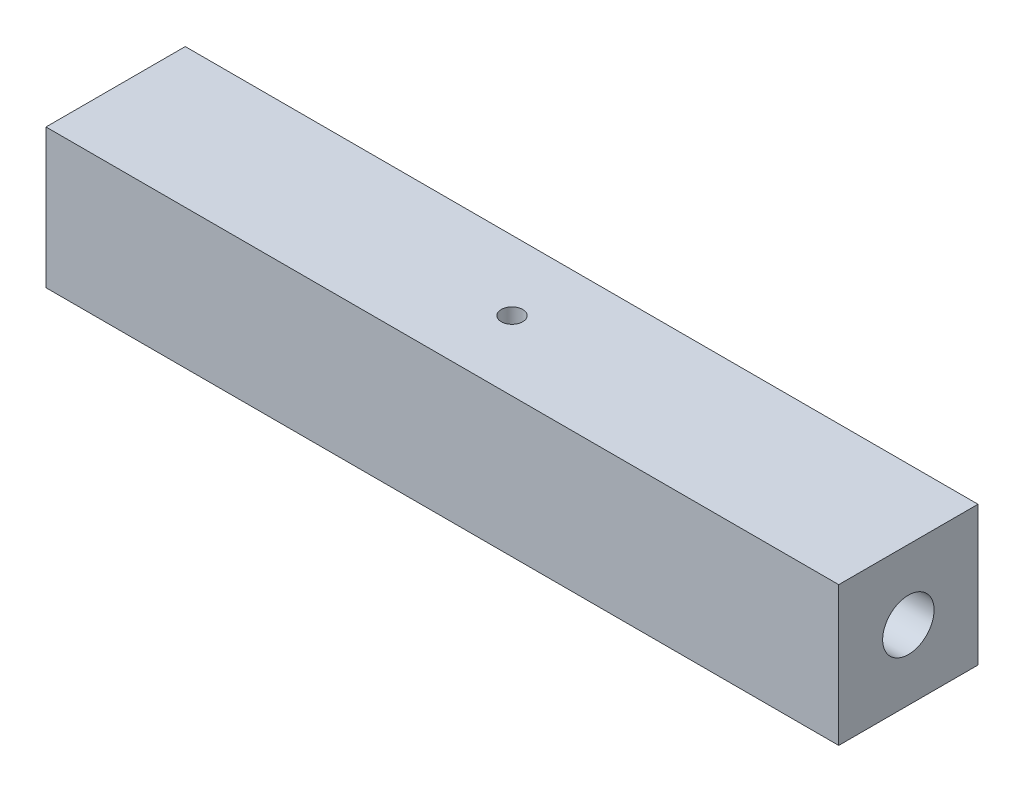
ISO-10303-21;
HEADER;
FILE_DESCRIPTION(('STEP AP214'),'2;1');
FILE_NAME('part.step','',(''),(''),'','','');
FILE_SCHEMA(('AUTOMOTIVE_DESIGN { 1 0 10303 214 1 1 1 1 }'));
ENDSEC;
DATA;
#1=APPLICATION_CONTEXT('core data for automotive mechanical design processes');
#2=APPLICATION_PROTOCOL_DEFINITION('international standard','automotive_design',2000,#1);
#3=PRODUCT_CONTEXT('',#1,'mechanical');
#4=PRODUCT('Part','Part','',(#3));
#5=PRODUCT_RELATED_PRODUCT_CATEGORY('part','',(#4));
#6=PRODUCT_DEFINITION_FORMATION('','',#4);
#7=PRODUCT_DEFINITION_CONTEXT('part definition',#1,'design');
#8=PRODUCT_DEFINITION('design','',#6,#7);
#9=PRODUCT_DEFINITION_SHAPE('','',#8);
#10=(LENGTH_UNIT() NAMED_UNIT(*) SI_UNIT(.MILLI.,.METRE.));
#11=(NAMED_UNIT(*) PLANE_ANGLE_UNIT() SI_UNIT($,.RADIAN.));
#12=(NAMED_UNIT(*) SI_UNIT($,.STERADIAN.) SOLID_ANGLE_UNIT());
#13=UNCERTAINTY_MEASURE_WITH_UNIT(LENGTH_MEASURE(1.E-05),#10,'distance_accuracy_value','');
#14=(GEOMETRIC_REPRESENTATION_CONTEXT(3) GLOBAL_UNCERTAINTY_ASSIGNED_CONTEXT((#13)) GLOBAL_UNIT_ASSIGNED_CONTEXT((#10,
#11,#12)) REPRESENTATION_CONTEXT('',''));
#15=CARTESIAN_POINT('',(0.,0.,0.));
#16=DIRECTION('',(0.,0.,1.));
#17=DIRECTION('',(1.,0.,0.));
#18=AXIS2_PLACEMENT_3D('',#15,#16,#17);
#19=CARTESIAN_POINT('',(46.99,8.255,8.255));
#20=DIRECTION('',(0.,-1.,0.));
#21=DIRECTION('',(0.,0.,-1.));
#22=AXIS2_PLACEMENT_3D('',#19,#20,#21);
#23=PLANE('',#22);
#24=DIRECTION('',(0.,0.,1.));
#25=VECTOR('',#24,1.);
#26=CARTESIAN_POINT('',(-46.99,8.255,8.255));
#27=LINE('',#26,#25);
#28=CARTESIAN_POINT('',(-46.99,8.255,-8.255));
#29=VERTEX_POINT('',#28);
#30=CARTESIAN_POINT('',(-46.99,8.255,8.255));
#31=VERTEX_POINT('',#30);
#32=EDGE_CURVE('E88',#29,#31,#27,.T.);
#33=ORIENTED_EDGE('',*,*,#32,.T.);
#34=DIRECTION('',(-1.,0.,0.));
#35=VECTOR('',#34,1.);
#36=CARTESIAN_POINT('',(46.99,8.255,8.255));
#37=LINE('',#36,#35);
#38=CARTESIAN_POINT('',(46.99,8.255,8.255));
#39=VERTEX_POINT('',#38);
#40=EDGE_CURVE('E41',#39,#31,#37,.T.);
#41=ORIENTED_EDGE('',*,*,#40,.F.);
#42=DIRECTION('',(0.,0.,1.));
#43=VECTOR('',#42,1.);
#44=CARTESIAN_POINT('',(46.99,8.255,8.255));
#45=LINE('',#44,#43);
#46=CARTESIAN_POINT('',(46.99,8.255,-8.255));
#47=VERTEX_POINT('',#46);
#48=EDGE_CURVE('E79',#47,#39,#45,.T.);
#49=ORIENTED_EDGE('',*,*,#48,.F.);
#50=DIRECTION('',(-1.,0.,0.));
#51=VECTOR('',#50,1.);
#52=CARTESIAN_POINT('',(46.99,8.255,-8.255));
#53=LINE('',#52,#51);
#54=EDGE_CURVE('E11',#47,#29,#53,.T.);
#55=ORIENTED_EDGE('',*,*,#54,.T.);
#56=EDGE_LOOP('',(#33,#41,#49,#55));
#57=FACE_BOUND('',#56,.T.);
#58=CARTESIAN_POINT('',(0.,8.255,0.));
#59=DIRECTION('',(0.,-1.,0.));
#60=DIRECTION('',(0.,0.,-1.));
#61=AXIS2_PLACEMENT_3D('',#58,#59,#60);
#62=CIRCLE('',#61,1.27);
#63=CARTESIAN_POINT('',(0.,8.255,-1.27));
#64=VERTEX_POINT('',#63);
#65=EDGE_CURVE('E124',#64,#64,#62,.T.);
#66=ORIENTED_EDGE('',*,*,#65,.T.);
#67=EDGE_LOOP('',(#66));
#68=FACE_BOUND('',#67,.T.);
#69=ADVANCED_FACE('F32',(#57,#68),#23,.F.);
#70=CARTESIAN_POINT('',(46.99,-8.255,8.255));
#71=DIRECTION('',(0.,1.,0.));
#72=DIRECTION('',(0.,0.,1.));
#73=AXIS2_PLACEMENT_3D('',#70,#71,#72);
#74=PLANE('',#73);
#75=DIRECTION('',(0.,0.,-1.));
#76=VECTOR('',#75,1.);
#77=CARTESIAN_POINT('',(-46.99,-8.255,8.255));
#78=LINE('',#77,#76);
#79=CARTESIAN_POINT('',(-46.99,-8.255,8.255));
#80=VERTEX_POINT('',#79);
#81=CARTESIAN_POINT('',(-46.99,-8.255,-8.255));
#82=VERTEX_POINT('',#81);
#83=EDGE_CURVE('E72',#80,#82,#78,.T.);
#84=ORIENTED_EDGE('',*,*,#83,.T.);
#85=DIRECTION('',(-1.,0.,0.));
#86=VECTOR('',#85,1.);
#87=CARTESIAN_POINT('',(46.99,-8.255,-8.255));
#88=LINE('',#87,#86);
#89=CARTESIAN_POINT('',(46.99,-8.255,-8.255));
#90=VERTEX_POINT('',#89);
#91=EDGE_CURVE('E92',#90,#82,#88,.T.);
#92=ORIENTED_EDGE('',*,*,#91,.F.);
#93=DIRECTION('',(0.,0.,-1.));
#94=VECTOR('',#93,1.);
#95=CARTESIAN_POINT('',(46.99,-8.255,8.255));
#96=LINE('',#95,#94);
#97=CARTESIAN_POINT('',(46.99,-8.255,8.255));
#98=VERTEX_POINT('',#97);
#99=EDGE_CURVE('E49',#98,#90,#96,.T.);
#100=ORIENTED_EDGE('',*,*,#99,.F.);
#101=DIRECTION('',(-1.,0.,0.));
#102=VECTOR('',#101,1.);
#103=CARTESIAN_POINT('',(46.99,-8.255,8.255));
#104=LINE('',#103,#102);
#105=EDGE_CURVE('E89',#98,#80,#104,.T.);
#106=ORIENTED_EDGE('',*,*,#105,.T.);
#107=EDGE_LOOP('',(#84,#92,#100,#106));
#108=FACE_BOUND('',#107,.T.);
#109=CARTESIAN_POINT('',(0.,-8.255,0.));
#110=DIRECTION('',(0.,-1.,0.));
#111=DIRECTION('',(0.,0.,-1.));
#112=AXIS2_PLACEMENT_3D('',#109,#110,#111);
#113=CIRCLE('',#112,1.27);
#114=CARTESIAN_POINT('',(0.,-8.255,-1.27));
#115=VERTEX_POINT('',#114);
#116=EDGE_CURVE('E121',#115,#115,#113,.T.);
#117=ORIENTED_EDGE('',*,*,#116,.F.);
#118=EDGE_LOOP('',(#117));
#119=FACE_BOUND('',#118,.T.);
#120=ADVANCED_FACE('F104',(#108,#119),#74,.F.);
#121=CARTESIAN_POINT('',(-46.99,0.,0.));
#122=DIRECTION('',(1.,0.,0.));
#123=DIRECTION('',(0.,0.,-1.));
#124=AXIS2_PLACEMENT_3D('',#121,#122,#123);
#125=PLANE('',#124);
#126=DIRECTION('',(0.,1.,0.));
#127=VECTOR('',#126,1.);
#128=CARTESIAN_POINT('',(-46.99,8.255,-8.255));
#129=LINE('',#128,#127);
#130=EDGE_CURVE('E96',#82,#29,#129,.T.);
#131=ORIENTED_EDGE('',*,*,#130,.F.);
#132=ORIENTED_EDGE('',*,*,#83,.F.);
#133=DIRECTION('',(0.,-1.,0.));
#134=VECTOR('',#133,1.);
#135=CARTESIAN_POINT('',(-46.99,8.255,8.255));
#136=LINE('',#135,#134);
#137=EDGE_CURVE('E66',#31,#80,#136,.T.);
#138=ORIENTED_EDGE('',*,*,#137,.F.);
#139=ORIENTED_EDGE('',*,*,#32,.F.);
#140=EDGE_LOOP('',(#131,#132,#138,#139));
#141=FACE_BOUND('',#140,.T.);
#142=CARTESIAN_POINT('',(-46.99,0.,0.));
#143=DIRECTION('',(1.,0.,0.));
#144=DIRECTION('',(0.,0.,-1.));
#145=AXIS2_PLACEMENT_3D('',#142,#143,#144);
#146=CIRCLE('',#145,3.048);
#147=CARTESIAN_POINT('',(-46.99,0.,-3.048));
#148=VERTEX_POINT('',#147);
#149=EDGE_CURVE('E118',#148,#148,#146,.T.);
#150=ORIENTED_EDGE('',*,*,#149,.T.);
#151=EDGE_LOOP('',(#150));
#152=FACE_BOUND('',#151,.T.);
#153=ADVANCED_FACE('F108',(#141,#152),#125,.F.);
#154=CARTESIAN_POINT('',(46.99,8.255,-8.255));
#155=DIRECTION('',(0.,0.,1.));
#156=DIRECTION('',(1.,0.,0.));
#157=AXIS2_PLACEMENT_3D('',#154,#155,#156);
#158=PLANE('',#157);
#159=ORIENTED_EDGE('',*,*,#130,.T.);
#160=ORIENTED_EDGE('',*,*,#54,.F.);
#161=DIRECTION('',(0.,1.,0.));
#162=VECTOR('',#161,1.);
#163=CARTESIAN_POINT('',(46.99,8.255,-8.255));
#164=LINE('',#163,#162);
#165=EDGE_CURVE('E84',#90,#47,#164,.T.);
#166=ORIENTED_EDGE('',*,*,#165,.F.);
#167=ORIENTED_EDGE('',*,*,#91,.T.);
#168=EDGE_LOOP('',(#159,#160,#166,#167));
#169=FACE_BOUND('',#168,.T.);
#170=ADVANCED_FACE('F34',(#169),#158,.F.);
#171=CARTESIAN_POINT('',(46.99,8.255,8.255));
#172=DIRECTION('',(0.,0.,-1.));
#173=DIRECTION('',(-1.,0.,0.));
#174=AXIS2_PLACEMENT_3D('',#171,#172,#173);
#175=PLANE('',#174);
#176=ORIENTED_EDGE('',*,*,#137,.T.);
#177=ORIENTED_EDGE('',*,*,#105,.F.);
#178=DIRECTION('',(0.,-1.,0.));
#179=VECTOR('',#178,1.);
#180=CARTESIAN_POINT('',(46.99,8.255,8.255));
#181=LINE('',#180,#179);
#182=EDGE_CURVE('E82',#39,#98,#181,.T.);
#183=ORIENTED_EDGE('',*,*,#182,.F.);
#184=ORIENTED_EDGE('',*,*,#40,.T.);
#185=EDGE_LOOP('',(#176,#177,#183,#184));
#186=FACE_BOUND('',#185,.T.);
#187=ADVANCED_FACE('F90',(#186),#175,.F.);
#188=CARTESIAN_POINT('',(46.99,0.,0.));
#189=DIRECTION('',(1.,0.,0.));
#190=DIRECTION('',(0.,0.,-1.));
#191=AXIS2_PLACEMENT_3D('',#188,#189,#190);
#192=PLANE('',#191);
#193=CARTESIAN_POINT('',(46.99,0.,0.));
#194=DIRECTION('',(1.,0.,0.));
#195=DIRECTION('',(0.,0.,-1.));
#196=AXIS2_PLACEMENT_3D('',#193,#194,#195);
#197=CIRCLE('',#196,3.048);
#198=CARTESIAN_POINT('',(46.99,0.,-3.048));
#199=VERTEX_POINT('',#198);
#200=EDGE_CURVE('E112',#199,#199,#197,.T.);
#201=ORIENTED_EDGE('',*,*,#200,.F.);
#202=EDGE_LOOP('',(#201));
#203=FACE_BOUND('',#202,.T.);
#204=ORIENTED_EDGE('',*,*,#165,.T.);
#205=ORIENTED_EDGE('',*,*,#48,.T.);
#206=ORIENTED_EDGE('',*,*,#182,.T.);
#207=ORIENTED_EDGE('',*,*,#99,.T.);
#208=EDGE_LOOP('',(#204,#205,#206,#207));
#209=FACE_BOUND('',#208,.T.);
#210=ADVANCED_FACE('F80',(#203,#209),#192,.T.);
#211=CARTESIAN_POINT('',(29.21,0.,0.));
#212=DIRECTION('',(1.,0.,0.));
#213=DIRECTION('',(0.,0.,-1.));
#214=AXIS2_PLACEMENT_3D('',#211,#212,#213);
#215=CYLINDRICAL_SURFACE('',#214,3.048);
#216=CARTESIAN_POINT('',(29.21,0.,0.));
#217=DIRECTION('',(1.,0.,0.));
#218=DIRECTION('',(0.,0.,-1.));
#219=AXIS2_PLACEMENT_3D('',#216,#217,#218);
#220=CIRCLE('',#219,3.048);
#221=CARTESIAN_POINT('',(29.21,0.,-3.048));
#222=VERTEX_POINT('',#221);
#223=EDGE_CURVE('E99',#222,#222,#220,.T.);
#224=ORIENTED_EDGE('',*,*,#223,.F.);
#225=EDGE_LOOP('',(#224));
#226=FACE_BOUND('',#225,.T.);
#227=ORIENTED_EDGE('',*,*,#200,.T.);
#228=EDGE_LOOP('',(#227));
#229=FACE_BOUND('',#228,.T.);
#230=ADVANCED_FACE('F146',(#226,#229),#215,.F.);
#231=CARTESIAN_POINT('',(29.21,0.,0.));
#232=DIRECTION('',(1.,0.,0.));
#233=DIRECTION('',(0.,0.,-1.));
#234=AXIS2_PLACEMENT_3D('',#231,#232,#233);
#235=PLANE('',#234);
#236=ORIENTED_EDGE('',*,*,#223,.T.);
#237=EDGE_LOOP('',(#236));
#238=FACE_BOUND('',#237,.T.);
#239=ADVANCED_FACE('F162',(#238),#235,.T.);
#240=CARTESIAN_POINT('',(-29.21,0.,0.));
#241=DIRECTION('',(-1.,0.,0.));
#242=DIRECTION('',(0.,0.,1.));
#243=AXIS2_PLACEMENT_3D('',#240,#241,#242);
#244=CYLINDRICAL_SURFACE('',#243,3.048);
#245=CARTESIAN_POINT('',(-29.21,0.,0.));
#246=DIRECTION('',(1.,0.,0.));
#247=DIRECTION('',(0.,0.,-1.));
#248=AXIS2_PLACEMENT_3D('',#245,#246,#247);
#249=CIRCLE('',#248,3.048);
#250=CARTESIAN_POINT('',(-29.21,0.,-3.048));
#251=VERTEX_POINT('',#250);
#252=EDGE_CURVE('E115',#251,#251,#249,.T.);
#253=ORIENTED_EDGE('',*,*,#252,.T.);
#254=EDGE_LOOP('',(#253));
#255=FACE_BOUND('',#254,.T.);
#256=ORIENTED_EDGE('',*,*,#149,.F.);
#257=EDGE_LOOP('',(#256));
#258=FACE_BOUND('',#257,.T.);
#259=ADVANCED_FACE('F166',(#255,#258),#244,.F.);
#260=CARTESIAN_POINT('',(-29.21,0.,0.));
#261=DIRECTION('',(-1.,0.,0.));
#262=DIRECTION('',(0.,0.,-1.));
#263=AXIS2_PLACEMENT_3D('',#260,#261,#262);
#264=PLANE('',#263);
#265=ORIENTED_EDGE('',*,*,#252,.F.);
#266=EDGE_LOOP('',(#265));
#267=FACE_BOUND('',#266,.T.);
#268=ADVANCED_FACE('F170',(#267),#264,.T.);
#269=CARTESIAN_POINT('',(0.,-8.255,0.));
#270=DIRECTION('',(0.,1.,0.));
#271=DIRECTION('',(0.,0.,1.));
#272=AXIS2_PLACEMENT_3D('',#269,#270,#271);
#273=CYLINDRICAL_SURFACE('',#272,1.27);
#274=ORIENTED_EDGE('',*,*,#116,.T.);
#275=EDGE_LOOP('',(#274));
#276=FACE_BOUND('',#275,.T.);
#277=ORIENTED_EDGE('',*,*,#65,.F.);
#278=EDGE_LOOP('',(#277));
#279=FACE_BOUND('',#278,.T.);
#280=ADVANCED_FACE('F130',(#276,#279),#273,.F.);
#281=CLOSED_SHELL('',(#69,#120,#153,#170,#187,#210,#230,#239,#259,#268,#280));
#282=MANIFOLD_SOLID_BREP('B2',#281);
#283=ADVANCED_BREP_SHAPE_REPRESENTATION('',(#18,#282),#14);
#284=SHAPE_DEFINITION_REPRESENTATION(#9,#283);
ENDSEC;
END-ISO-10303-21;
